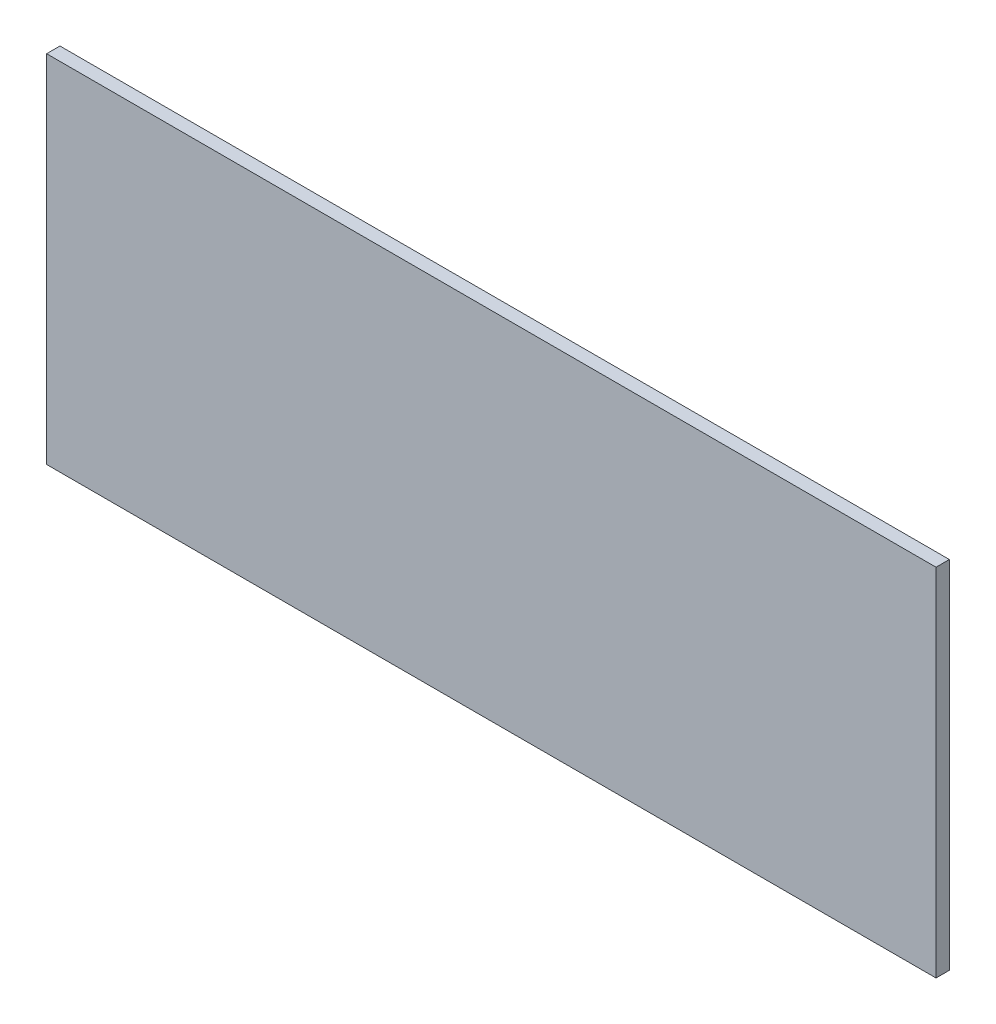
ISO-10303-21;
HEADER;
FILE_DESCRIPTION(('STEP AP214'),'2;1');
FILE_NAME('part.step','',(''),(''),'','','');
FILE_SCHEMA(('AUTOMOTIVE_DESIGN { 1 0 10303 214 1 1 1 1 }'));
ENDSEC;
DATA;
#1=APPLICATION_CONTEXT('core data for automotive mechanical design processes');
#2=APPLICATION_PROTOCOL_DEFINITION('international standard','automotive_design',2000,#1);
#3=PRODUCT_CONTEXT('',#1,'mechanical');
#4=PRODUCT('Part','Part','',(#3));
#5=PRODUCT_RELATED_PRODUCT_CATEGORY('part','',(#4));
#6=PRODUCT_DEFINITION_FORMATION('','',#4);
#7=PRODUCT_DEFINITION_CONTEXT('part definition',#1,'design');
#8=PRODUCT_DEFINITION('design','',#6,#7);
#9=PRODUCT_DEFINITION_SHAPE('','',#8);
#10=(LENGTH_UNIT() NAMED_UNIT(*) SI_UNIT(.MILLI.,.METRE.));
#11=(NAMED_UNIT(*) PLANE_ANGLE_UNIT() SI_UNIT($,.RADIAN.));
#12=(NAMED_UNIT(*) SI_UNIT($,.STERADIAN.) SOLID_ANGLE_UNIT());
#13=UNCERTAINTY_MEASURE_WITH_UNIT(LENGTH_MEASURE(1.E-05),#10,'distance_accuracy_value','');
#14=(GEOMETRIC_REPRESENTATION_CONTEXT(3) GLOBAL_UNCERTAINTY_ASSIGNED_CONTEXT((#13)) GLOBAL_UNIT_ASSIGNED_CONTEXT((#10,
#11,#12)) REPRESENTATION_CONTEXT('',''));
#15=CARTESIAN_POINT('',(0.,0.,0.));
#16=DIRECTION('',(0.,0.,1.));
#17=DIRECTION('',(1.,0.,0.));
#18=AXIS2_PLACEMENT_3D('',#15,#16,#17);
#19=CARTESIAN_POINT('',(100.,40.,3.));
#20=DIRECTION('',(-1.,0.,0.));
#21=DIRECTION('',(0.,-1.,0.));
#22=AXIS2_PLACEMENT_3D('',#19,#20,#21);
#23=PLANE('',#22);
#24=DIRECTION('',(0.,1.,0.));
#25=VECTOR('',#24,1.);
#26=CARTESIAN_POINT('',(100.,40.,0.));
#27=LINE('',#26,#25);
#28=CARTESIAN_POINT('',(100.,-40.,0.));
#29=VERTEX_POINT('',#28);
#30=CARTESIAN_POINT('',(100.,40.,0.));
#31=VERTEX_POINT('',#30);
#32=EDGE_CURVE('E97',#29,#31,#27,.T.);
#33=ORIENTED_EDGE('',*,*,#32,.T.);
#34=DIRECTION('',(0.,0.,-1.));
#35=VECTOR('',#34,1.);
#36=CARTESIAN_POINT('',(100.,40.,3.));
#37=LINE('',#36,#35);
#38=CARTESIAN_POINT('',(100.,40.,3.));
#39=VERTEX_POINT('',#38);
#40=EDGE_CURVE('E11',#39,#31,#37,.T.);
#41=ORIENTED_EDGE('',*,*,#40,.F.);
#42=DIRECTION('',(0.,1.,0.));
#43=VECTOR('',#42,1.);
#44=CARTESIAN_POINT('',(100.,40.,3.));
#45=LINE('',#44,#43);
#46=CARTESIAN_POINT('',(100.,-40.,3.));
#47=VERTEX_POINT('',#46);
#48=EDGE_CURVE('E85',#47,#39,#45,.T.);
#49=ORIENTED_EDGE('',*,*,#48,.F.);
#50=DIRECTION('',(0.,0.,-1.));
#51=VECTOR('',#50,1.);
#52=CARTESIAN_POINT('',(100.,-40.,3.));
#53=LINE('',#52,#51);
#54=EDGE_CURVE('E93',#47,#29,#53,.T.);
#55=ORIENTED_EDGE('',*,*,#54,.T.);
#56=EDGE_LOOP('',(#33,#41,#49,#55));
#57=FACE_BOUND('',#56,.T.);
#58=ADVANCED_FACE('F34',(#57),#23,.F.);
#59=CARTESIAN_POINT('',(-100.,40.,3.));
#60=DIRECTION('',(0.,-1.,0.));
#61=DIRECTION('',(0.,0.,-1.));
#62=AXIS2_PLACEMENT_3D('',#59,#60,#61);
#63=PLANE('',#62);
#64=DIRECTION('',(-1.,0.,0.));
#65=VECTOR('',#64,1.);
#66=CARTESIAN_POINT('',(-100.,40.,0.));
#67=LINE('',#66,#65);
#68=CARTESIAN_POINT('',(-100.,40.,0.));
#69=VERTEX_POINT('',#68);
#70=EDGE_CURVE('E89',#31,#69,#67,.T.);
#71=ORIENTED_EDGE('',*,*,#70,.T.);
#72=DIRECTION('',(0.,0.,-1.));
#73=VECTOR('',#72,1.);
#74=CARTESIAN_POINT('',(-100.,40.,3.));
#75=LINE('',#74,#73);
#76=CARTESIAN_POINT('',(-100.,40.,3.));
#77=VERTEX_POINT('',#76);
#78=EDGE_CURVE('E42',#77,#69,#75,.T.);
#79=ORIENTED_EDGE('',*,*,#78,.F.);
#80=DIRECTION('',(-1.,0.,0.));
#81=VECTOR('',#80,1.);
#82=CARTESIAN_POINT('',(-100.,40.,3.));
#83=LINE('',#82,#81);
#84=EDGE_CURVE('E80',#39,#77,#83,.T.);
#85=ORIENTED_EDGE('',*,*,#84,.F.);
#86=ORIENTED_EDGE('',*,*,#40,.T.);
#87=EDGE_LOOP('',(#71,#79,#85,#86));
#88=FACE_BOUND('',#87,.T.);
#89=ADVANCED_FACE('F88',(#88),#63,.F.);
#90=CARTESIAN_POINT('',(-100.,40.,3.));
#91=DIRECTION('',(1.,0.,0.));
#92=DIRECTION('',(0.,1.,0.));
#93=AXIS2_PLACEMENT_3D('',#90,#91,#92);
#94=PLANE('',#93);
#95=DIRECTION('',(0.,-1.,0.));
#96=VECTOR('',#95,1.);
#97=CARTESIAN_POINT('',(-100.,40.,0.));
#98=LINE('',#97,#96);
#99=CARTESIAN_POINT('',(-100.,-40.,0.));
#100=VERTEX_POINT('',#99);
#101=EDGE_CURVE('E67',#69,#100,#98,.T.);
#102=ORIENTED_EDGE('',*,*,#101,.T.);
#103=DIRECTION('',(0.,0.,-1.));
#104=VECTOR('',#103,1.);
#105=CARTESIAN_POINT('',(-100.,-40.,3.));
#106=LINE('',#105,#104);
#107=CARTESIAN_POINT('',(-100.,-40.,3.));
#108=VERTEX_POINT('',#107);
#109=EDGE_CURVE('E90',#108,#100,#106,.T.);
#110=ORIENTED_EDGE('',*,*,#109,.F.);
#111=DIRECTION('',(0.,-1.,0.));
#112=VECTOR('',#111,1.);
#113=CARTESIAN_POINT('',(-100.,40.,3.));
#114=LINE('',#113,#112);
#115=EDGE_CURVE('E83',#77,#108,#114,.T.);
#116=ORIENTED_EDGE('',*,*,#115,.F.);
#117=ORIENTED_EDGE('',*,*,#78,.T.);
#118=EDGE_LOOP('',(#102,#110,#116,#117));
#119=FACE_BOUND('',#118,.T.);
#120=ADVANCED_FACE('F91',(#119),#94,.F.);
#121=CARTESIAN_POINT('',(-100.,-40.,3.));
#122=DIRECTION('',(0.,1.,0.));
#123=DIRECTION('',(0.,0.,1.));
#124=AXIS2_PLACEMENT_3D('',#121,#122,#123);
#125=PLANE('',#124);
#126=DIRECTION('',(1.,0.,0.));
#127=VECTOR('',#126,1.);
#128=CARTESIAN_POINT('',(-100.,-40.,0.));
#129=LINE('',#128,#127);
#130=EDGE_CURVE('E73',#100,#29,#129,.T.);
#131=ORIENTED_EDGE('',*,*,#130,.T.);
#132=ORIENTED_EDGE('',*,*,#54,.F.);
#133=DIRECTION('',(1.,0.,0.));
#134=VECTOR('',#133,1.);
#135=CARTESIAN_POINT('',(-100.,-40.,3.));
#136=LINE('',#135,#134);
#137=EDGE_CURVE('E50',#108,#47,#136,.T.);
#138=ORIENTED_EDGE('',*,*,#137,.F.);
#139=ORIENTED_EDGE('',*,*,#109,.T.);
#140=EDGE_LOOP('',(#131,#132,#138,#139));
#141=FACE_BOUND('',#140,.T.);
#142=ADVANCED_FACE('F104',(#141),#125,.F.);
#143=CARTESIAN_POINT('',(0.,0.,3.));
#144=DIRECTION('',(0.,0.,1.));
#145=DIRECTION('',(1.,0.,0.));
#146=AXIS2_PLACEMENT_3D('',#143,#144,#145);
#147=PLANE('',#146);
#148=ORIENTED_EDGE('',*,*,#48,.T.);
#149=ORIENTED_EDGE('',*,*,#84,.T.);
#150=ORIENTED_EDGE('',*,*,#115,.T.);
#151=ORIENTED_EDGE('',*,*,#137,.T.);
#152=EDGE_LOOP('',(#148,#149,#150,#151));
#153=FACE_BOUND('',#152,.T.);
#154=ADVANCED_FACE('F81',(#153),#147,.T.);
#155=CARTESIAN_POINT('',(0.,0.,0.));
#156=DIRECTION('',(0.,0.,1.));
#157=DIRECTION('',(1.,0.,0.));
#158=AXIS2_PLACEMENT_3D('',#155,#156,#157);
#159=PLANE('',#158);
#160=ORIENTED_EDGE('',*,*,#32,.F.);
#161=ORIENTED_EDGE('',*,*,#130,.F.);
#162=ORIENTED_EDGE('',*,*,#101,.F.);
#163=ORIENTED_EDGE('',*,*,#70,.F.);
#164=EDGE_LOOP('',(#160,#161,#162,#163));
#165=FACE_BOUND('',#164,.T.);
#166=ADVANCED_FACE('F107',(#165),#159,.F.);
#167=CLOSED_SHELL('',(#58,#89,#120,#142,#154,#166));
#168=MANIFOLD_SOLID_BREP('B2',#167);
#169=ADVANCED_BREP_SHAPE_REPRESENTATION('',(#18,#168),#14);
#170=SHAPE_DEFINITION_REPRESENTATION(#9,#169);
ENDSEC;
END-ISO-10303-21;
